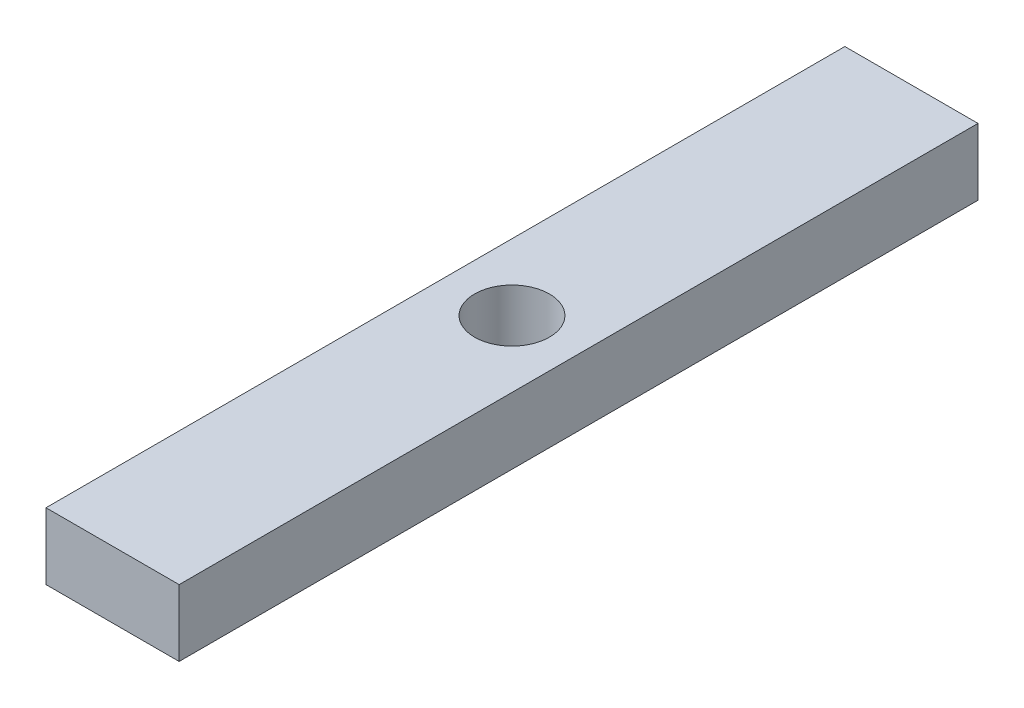
ISO-10303-21;
HEADER;
FILE_DESCRIPTION(('STEP AP214'),'2;1');
FILE_NAME('part.step','',(''),(''),'','','');
FILE_SCHEMA(('AUTOMOTIVE_DESIGN { 1 0 10303 214 1 1 1 1 }'));
ENDSEC;
DATA;
#1=APPLICATION_CONTEXT('core data for automotive mechanical design processes');
#2=APPLICATION_PROTOCOL_DEFINITION('international standard','automotive_design',2000,#1);
#3=PRODUCT_CONTEXT('',#1,'mechanical');
#4=PRODUCT('Part','Part','',(#3));
#5=PRODUCT_RELATED_PRODUCT_CATEGORY('part','',(#4));
#6=PRODUCT_DEFINITION_FORMATION('','',#4);
#7=PRODUCT_DEFINITION_CONTEXT('part definition',#1,'design');
#8=PRODUCT_DEFINITION('design','',#6,#7);
#9=PRODUCT_DEFINITION_SHAPE('','',#8);
#10=(LENGTH_UNIT() NAMED_UNIT(*) SI_UNIT(.MILLI.,.METRE.));
#11=(NAMED_UNIT(*) PLANE_ANGLE_UNIT() SI_UNIT($,.RADIAN.));
#12=(NAMED_UNIT(*) SI_UNIT($,.STERADIAN.) SOLID_ANGLE_UNIT());
#13=UNCERTAINTY_MEASURE_WITH_UNIT(LENGTH_MEASURE(1.E-05),#10,'distance_accuracy_value','');
#14=(GEOMETRIC_REPRESENTATION_CONTEXT(3) GLOBAL_UNCERTAINTY_ASSIGNED_CONTEXT((#13)) GLOBAL_UNIT_ASSIGNED_CONTEXT((#10,
#11,#12)) REPRESENTATION_CONTEXT('',''));
#15=CARTESIAN_POINT('',(0.,0.,0.));
#16=DIRECTION('',(0.,0.,1.));
#17=DIRECTION('',(1.,0.,0.));
#18=AXIS2_PLACEMENT_3D('',#15,#16,#17);
#19=CARTESIAN_POINT('',(0.,25.4,0.));
#20=DIRECTION('',(0.,-1.,0.));
#21=DIRECTION('',(0.,0.,-1.));
#22=AXIS2_PLACEMENT_3D('',#19,#20,#21);
#23=PLANE('',#22);
#24=DIRECTION('',(0.,0.,1.));
#25=VECTOR('',#24,1.);
#26=CARTESIAN_POINT('',(0.,25.4,0.));
#27=LINE('',#26,#25);
#28=CARTESIAN_POINT('',(0.,25.4,-304.8));
#29=VERTEX_POINT('',#28);
#30=CARTESIAN_POINT('',(0.,25.4,0.));
#31=VERTEX_POINT('',#30);
#32=EDGE_CURVE('E98',#29,#31,#27,.T.);
#33=ORIENTED_EDGE('',*,*,#32,.T.);
#34=DIRECTION('',(1.,0.,0.));
#35=VECTOR('',#34,1.);
#36=CARTESIAN_POINT('',(0.,25.4,0.));
#37=LINE('',#36,#35);
#38=CARTESIAN_POINT('',(50.8,25.4,0.));
#39=VERTEX_POINT('',#38);
#40=EDGE_CURVE('E93',#31,#39,#37,.T.);
#41=ORIENTED_EDGE('',*,*,#40,.T.);
#42=DIRECTION('',(0.,0.,-1.));
#43=VECTOR('',#42,1.);
#44=CARTESIAN_POINT('',(50.8,25.4,0.));
#45=LINE('',#44,#43);
#46=CARTESIAN_POINT('',(50.8,25.4,-304.8));
#47=VERTEX_POINT('',#46);
#48=EDGE_CURVE('E96',#39,#47,#45,.T.);
#49=ORIENTED_EDGE('',*,*,#48,.T.);
#50=DIRECTION('',(-1.,0.,0.));
#51=VECTOR('',#50,1.);
#52=CARTESIAN_POINT('',(0.,25.4,-304.8));
#53=LINE('',#52,#51);
#54=EDGE_CURVE('E63',#47,#29,#53,.T.);
#55=ORIENTED_EDGE('',*,*,#54,.T.);
#56=EDGE_LOOP('',(#33,#41,#49,#55));
#57=FACE_BOUND('',#56,.T.);
#58=CARTESIAN_POINT('',(25.4,25.4,-152.4));
#59=DIRECTION('',(0.,1.,0.));
#60=DIRECTION('',(0.,0.,1.));
#61=AXIS2_PLACEMENT_3D('',#58,#59,#60);
#62=CIRCLE('',#61,14.2875);
#63=CARTESIAN_POINT('',(25.4,25.4,-138.1125));
#64=VERTEX_POINT('',#63);
#65=EDGE_CURVE('E118',#64,#64,#62,.T.);
#66=ORIENTED_EDGE('',*,*,#65,.F.);
#67=EDGE_LOOP('',(#66));
#68=FACE_BOUND('',#67,.T.);
#69=ADVANCED_FACE('F45',(#57,#68),#23,.F.);
#70=CARTESIAN_POINT('',(0.,0.,0.));
#71=DIRECTION('',(0.,-1.,0.));
#72=DIRECTION('',(0.,0.,-1.));
#73=AXIS2_PLACEMENT_3D('',#70,#71,#72);
#74=PLANE('',#73);
#75=DIRECTION('',(0.,0.,1.));
#76=VECTOR('',#75,1.);
#77=CARTESIAN_POINT('',(0.,0.,0.));
#78=LINE('',#77,#76);
#79=CARTESIAN_POINT('',(0.,0.,-304.8));
#80=VERTEX_POINT('',#79);
#81=CARTESIAN_POINT('',(0.,0.,0.));
#82=VERTEX_POINT('',#81);
#83=EDGE_CURVE('E114',#80,#82,#78,.T.);
#84=ORIENTED_EDGE('',*,*,#83,.F.);
#85=DIRECTION('',(-1.,0.,0.));
#86=VECTOR('',#85,1.);
#87=CARTESIAN_POINT('',(0.,0.,-304.8));
#88=LINE('',#87,#86);
#89=CARTESIAN_POINT('',(50.8,0.,-304.8));
#90=VERTEX_POINT('',#89);
#91=EDGE_CURVE('E86',#90,#80,#88,.T.);
#92=ORIENTED_EDGE('',*,*,#91,.F.);
#93=DIRECTION('',(0.,0.,-1.));
#94=VECTOR('',#93,1.);
#95=CARTESIAN_POINT('',(50.8,0.,0.));
#96=LINE('',#95,#94);
#97=CARTESIAN_POINT('',(50.8,0.,0.));
#98=VERTEX_POINT('',#97);
#99=EDGE_CURVE('E80',#98,#90,#96,.T.);
#100=ORIENTED_EDGE('',*,*,#99,.F.);
#101=DIRECTION('',(1.,0.,0.));
#102=VECTOR('',#101,1.);
#103=CARTESIAN_POINT('',(0.,0.,0.));
#104=LINE('',#103,#102);
#105=EDGE_CURVE('E103',#82,#98,#104,.T.);
#106=ORIENTED_EDGE('',*,*,#105,.F.);
#107=EDGE_LOOP('',(#84,#92,#100,#106));
#108=FACE_BOUND('',#107,.T.);
#109=CARTESIAN_POINT('',(25.4,0.,-152.4));
#110=DIRECTION('',(0.,1.,0.));
#111=DIRECTION('',(0.,0.,1.));
#112=AXIS2_PLACEMENT_3D('',#109,#110,#111);
#113=CIRCLE('',#112,14.2875);
#114=CARTESIAN_POINT('',(25.4,0.,-138.1125));
#115=VERTEX_POINT('',#114);
#116=EDGE_CURVE('E136',#115,#115,#113,.T.);
#117=ORIENTED_EDGE('',*,*,#116,.T.);
#118=EDGE_LOOP('',(#117));
#119=FACE_BOUND('',#118,.T.);
#120=ADVANCED_FACE('F131',(#108,#119),#74,.T.);
#121=CARTESIAN_POINT('',(0.,25.4,0.));
#122=DIRECTION('',(1.,0.,0.));
#123=DIRECTION('',(0.,0.,-1.));
#124=AXIS2_PLACEMENT_3D('',#121,#122,#123);
#125=PLANE('',#124);
#126=ORIENTED_EDGE('',*,*,#83,.T.);
#127=DIRECTION('',(0.,-1.,0.));
#128=VECTOR('',#127,1.);
#129=CARTESIAN_POINT('',(0.,25.4,0.));
#130=LINE('',#129,#128);
#131=EDGE_CURVE('E11',#31,#82,#130,.T.);
#132=ORIENTED_EDGE('',*,*,#131,.F.);
#133=ORIENTED_EDGE('',*,*,#32,.F.);
#134=DIRECTION('',(0.,-1.,0.));
#135=VECTOR('',#134,1.);
#136=CARTESIAN_POINT('',(0.,25.4,-304.8));
#137=LINE('',#136,#135);
#138=EDGE_CURVE('E110',#29,#80,#137,.T.);
#139=ORIENTED_EDGE('',*,*,#138,.T.);
#140=EDGE_LOOP('',(#126,#132,#133,#139));
#141=FACE_BOUND('',#140,.T.);
#142=ADVANCED_FACE('F47',(#141),#125,.F.);
#143=CARTESIAN_POINT('',(0.,25.4,0.));
#144=DIRECTION('',(0.,0.,-1.));
#145=DIRECTION('',(-1.,0.,0.));
#146=AXIS2_PLACEMENT_3D('',#143,#144,#145);
#147=PLANE('',#146);
#148=ORIENTED_EDGE('',*,*,#105,.T.);
#149=DIRECTION('',(0.,-1.,0.));
#150=VECTOR('',#149,1.);
#151=CARTESIAN_POINT('',(50.8,25.4,0.));
#152=LINE('',#151,#150);
#153=EDGE_CURVE('E55',#39,#98,#152,.T.);
#154=ORIENTED_EDGE('',*,*,#153,.F.);
#155=ORIENTED_EDGE('',*,*,#40,.F.);
#156=ORIENTED_EDGE('',*,*,#131,.T.);
#157=EDGE_LOOP('',(#148,#154,#155,#156));
#158=FACE_BOUND('',#157,.T.);
#159=ADVANCED_FACE('F102',(#158),#147,.F.);
#160=CARTESIAN_POINT('',(50.8,25.4,0.));
#161=DIRECTION('',(-1.,0.,0.));
#162=DIRECTION('',(0.,0.,1.));
#163=AXIS2_PLACEMENT_3D('',#160,#161,#162);
#164=PLANE('',#163);
#165=ORIENTED_EDGE('',*,*,#99,.T.);
#166=DIRECTION('',(0.,-1.,0.));
#167=VECTOR('',#166,1.);
#168=CARTESIAN_POINT('',(50.8,25.4,-304.8));
#169=LINE('',#168,#167);
#170=EDGE_CURVE('E105',#47,#90,#169,.T.);
#171=ORIENTED_EDGE('',*,*,#170,.F.);
#172=ORIENTED_EDGE('',*,*,#48,.F.);
#173=ORIENTED_EDGE('',*,*,#153,.T.);
#174=EDGE_LOOP('',(#165,#171,#172,#173));
#175=FACE_BOUND('',#174,.T.);
#176=ADVANCED_FACE('F106',(#175),#164,.F.);
#177=CARTESIAN_POINT('',(0.,25.4,-304.8));
#178=DIRECTION('',(0.,0.,1.));
#179=DIRECTION('',(1.,0.,0.));
#180=AXIS2_PLACEMENT_3D('',#177,#178,#179);
#181=PLANE('',#180);
#182=ORIENTED_EDGE('',*,*,#91,.T.);
#183=ORIENTED_EDGE('',*,*,#138,.F.);
#184=ORIENTED_EDGE('',*,*,#54,.F.);
#185=ORIENTED_EDGE('',*,*,#170,.T.);
#186=EDGE_LOOP('',(#182,#183,#184,#185));
#187=FACE_BOUND('',#186,.T.);
#188=ADVANCED_FACE('F128',(#187),#181,.F.);
#189=CARTESIAN_POINT('',(25.4,25.4,-152.4));
#190=DIRECTION('',(0.,-1.,0.));
#191=DIRECTION('',(0.,0.,-1.));
#192=AXIS2_PLACEMENT_3D('',#189,#190,#191);
#193=CYLINDRICAL_SURFACE('',#192,14.2875);
#194=ORIENTED_EDGE('',*,*,#65,.T.);
#195=EDGE_LOOP('',(#194));
#196=FACE_BOUND('',#195,.T.);
#197=ORIENTED_EDGE('',*,*,#116,.F.);
#198=EDGE_LOOP('',(#197));
#199=FACE_BOUND('',#198,.T.);
#200=ADVANCED_FACE('F144',(#196,#199),#193,.F.);
#201=CLOSED_SHELL('',(#69,#120,#142,#159,#176,#188,#200));
#202=MANIFOLD_SOLID_BREP('B2',#201);
#203=ADVANCED_BREP_SHAPE_REPRESENTATION('',(#18,#202),#14);
#204=SHAPE_DEFINITION_REPRESENTATION(#9,#203);
ENDSEC;
END-ISO-10303-21;
